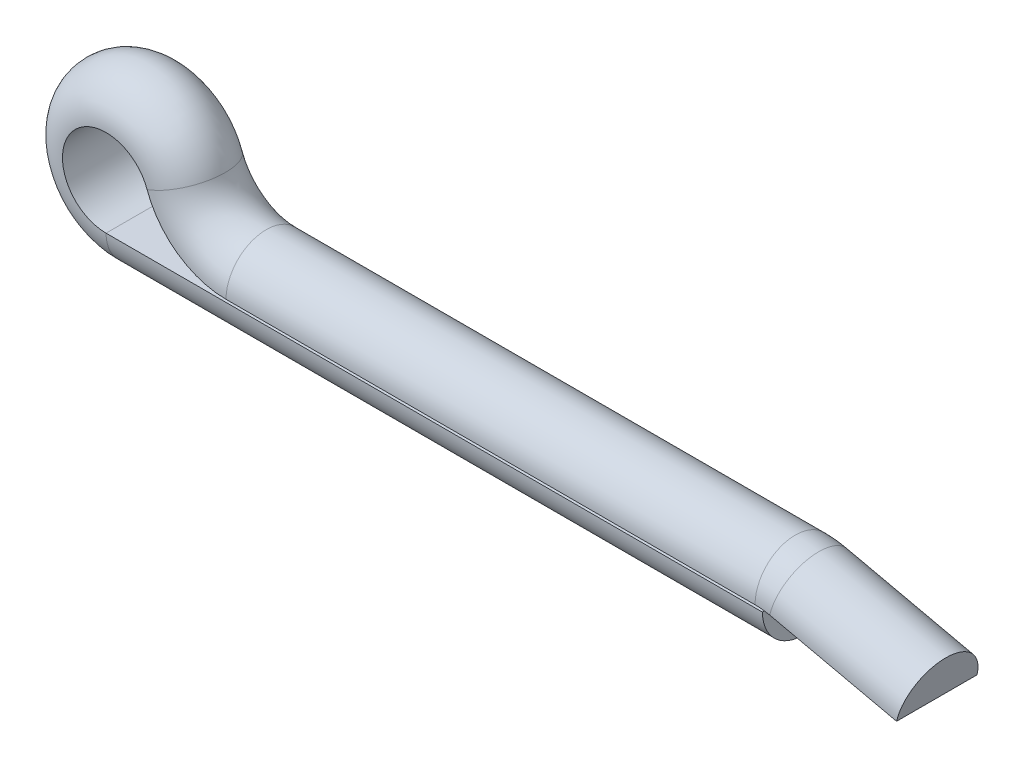
ISO-10303-21;
HEADER;
FILE_DESCRIPTION(('STEP AP214'),'2;1');
FILE_NAME('part.step','',(''),(''),'','','');
FILE_SCHEMA(('AUTOMOTIVE_DESIGN { 1 0 10303 214 1 1 1 1 }'));
ENDSEC;
DATA;
#1=APPLICATION_CONTEXT('core data for automotive mechanical design processes');
#2=APPLICATION_PROTOCOL_DEFINITION('international standard','automotive_design',2000,#1);
#3=PRODUCT_CONTEXT('',#1,'mechanical');
#4=PRODUCT('Part','Part','',(#3));
#5=PRODUCT_RELATED_PRODUCT_CATEGORY('part','',(#4));
#6=PRODUCT_DEFINITION_FORMATION('','',#4);
#7=PRODUCT_DEFINITION_CONTEXT('part definition',#1,'design');
#8=PRODUCT_DEFINITION('design','',#6,#7);
#9=PRODUCT_DEFINITION_SHAPE('','',#8);
#10=(LENGTH_UNIT() NAMED_UNIT(*) SI_UNIT(.MILLI.,.METRE.));
#11=(NAMED_UNIT(*) PLANE_ANGLE_UNIT() SI_UNIT($,.RADIAN.));
#12=(NAMED_UNIT(*) SI_UNIT($,.STERADIAN.) SOLID_ANGLE_UNIT());
#13=UNCERTAINTY_MEASURE_WITH_UNIT(LENGTH_MEASURE(1.E-05),#10,'distance_accuracy_value','');
#14=(GEOMETRIC_REPRESENTATION_CONTEXT(3) GLOBAL_UNCERTAINTY_ASSIGNED_CONTEXT((#13)) GLOBAL_UNIT_ASSIGNED_CONTEXT((#10,
#11,#12)) REPRESENTATION_CONTEXT('',''));
#15=CARTESIAN_POINT('',(0.,0.,0.));
#16=DIRECTION('',(0.,0.,1.));
#17=DIRECTION('',(1.,0.,0.));
#18=AXIS2_PLACEMENT_3D('',#15,#16,#17);
#19=CARTESIAN_POINT('',(0.137669376693772,-0.00557560975612573,0.762));
#20=DIRECTION('',(0.219512195121951,0.975609756097561,0.));
#21=DIRECTION('',(-0.975609756097561,0.219512195121951,0.));
#22=AXIS2_PLACEMENT_3D('',#19,#20,#21);
#23=PLANE('',#22);
#24=DIRECTION('',(0.,0.,1.));
#25=VECTOR('',#24,1.);
#26=CARTESIAN_POINT('',(0.137669376693772,-0.00557560975612573,0.762));
#27=LINE('',#26,#25);
#28=CARTESIAN_POINT('',(0.137669376693772,-0.00557560975612573,-0.762));
#29=VERTEX_POINT('',#28);
#30=CARTESIAN_POINT('',(0.137669376693772,-0.00557560975612573,0.762));
#31=VERTEX_POINT('',#30);
#32=EDGE_CURVE('E171',#29,#31,#27,.T.);
#33=ORIENTED_EDGE('',*,*,#32,.F.);
#34=DIRECTION('',(0.975609756097561,-0.219512195121951,0.));
#35=VECTOR('',#34,1.);
#36=CARTESIAN_POINT('',(0.137669376693772,-0.00557560975612573,-0.762));
#37=LINE('',#36,#35);
#38=CARTESIAN_POINT('',(2.54000000000001,-0.546100000000028,-0.762));
#39=VERTEX_POINT('',#38);
#40=EDGE_CURVE('E53',#29,#39,#37,.T.);
#41=ORIENTED_EDGE('',*,*,#40,.T.);
#42=DIRECTION('',(0.,0.,1.));
#43=VECTOR('',#42,1.);
#44=CARTESIAN_POINT('',(2.54000000000001,-0.546100000000028,0.762));
#45=LINE('',#44,#43);
#46=CARTESIAN_POINT('',(2.54000000000001,-0.546100000000028,0.762));
#47=VERTEX_POINT('',#46);
#48=EDGE_CURVE('E60',#39,#47,#45,.T.);
#49=ORIENTED_EDGE('',*,*,#48,.T.);
#50=DIRECTION('',(0.975609756097561,-0.219512195121951,0.));
#51=VECTOR('',#50,1.);
#52=CARTESIAN_POINT('',(0.137669376693772,-0.00557560975612573,0.762));
#53=LINE('',#52,#51);
#54=EDGE_CURVE('E13',#31,#47,#53,.T.);
#55=ORIENTED_EDGE('',*,*,#54,.F.);
#56=EDGE_LOOP('',(#33,#41,#49,#55));
#57=FACE_BOUND('',#56,.T.);
#58=ADVANCED_FACE('F46',(#57),#23,.F.);
#59=CARTESIAN_POINT('',(0.137669376693772,-0.00557560975612573,0.));
#60=DIRECTION('',(0.975609756097561,-0.219512195121951,0.));
#61=DIRECTION('',(0.219512195121951,0.975609756097561,0.));
#62=AXIS2_PLACEMENT_3D('',#59,#60,#61);
#63=CYLINDRICAL_SURFACE('',#62,0.762);
#64=CARTESIAN_POINT('',(0.137669376693772,-0.00557560975612573,0.));
#65=DIRECTION('',(-0.975609756097558,0.219512195121964,0.));
#66=DIRECTION('',(0.,0.,1.));
#67=AXIS2_PLACEMENT_3D('',#64,#65,#66);
#68=CIRCLE('',#67,0.762);
#69=EDGE_CURVE('E168',#31,#29,#68,.T.);
#70=ORIENTED_EDGE('',*,*,#69,.F.);
#71=ORIENTED_EDGE('',*,*,#54,.T.);
#72=CARTESIAN_POINT('',(2.54000000000001,-0.546100000000028,0.));
#73=DIRECTION('',(-0.975609756097558,0.219512195121964,0.));
#74=DIRECTION('',(0.,0.,1.));
#75=AXIS2_PLACEMENT_3D('',#72,#73,#74);
#76=CIRCLE('',#75,0.762);
#77=EDGE_CURVE('E66',#47,#39,#76,.T.);
#78=ORIENTED_EDGE('',*,*,#77,.T.);
#79=ORIENTED_EDGE('',*,*,#40,.F.);
#80=EDGE_LOOP('',(#70,#71,#78,#79));
#81=FACE_BOUND('',#80,.T.);
#82=ADVANCED_FACE('F183',(#81),#63,.T.);
#83=CARTESIAN_POINT('',(-0.141111111111112,-1.2446,0.));
#84=DIRECTION('',(0.,0.,-1.));
#85=DIRECTION('',(-1.,0.,0.));
#86=AXIS2_PLACEMENT_3D('',#83,#84,#85);
#87=CYLINDRICAL_SURFACE('',#86,1.26999999999997);
#88=DIRECTION('',(0.,0.,1.));
#89=VECTOR('',#88,1.);
#90=CARTESIAN_POINT('',(-0.141111111111101,0.0253999999999736,0.762));
#91=LINE('',#90,#89);
#92=CARTESIAN_POINT('',(-0.141111111111101,0.0253999999999736,-0.762));
#93=VERTEX_POINT('',#92);
#94=CARTESIAN_POINT('',(-0.141111111111101,0.0253999999999736,0.762));
#95=VERTEX_POINT('',#94);
#96=EDGE_CURVE('E159',#93,#95,#91,.T.);
#97=ORIENTED_EDGE('',*,*,#96,.F.);
#98=CARTESIAN_POINT('',(-0.141111111111112,-1.2446,-0.762));
#99=DIRECTION('',(0.,0.,-1.));
#100=DIRECTION('',(-1.,0.,0.));
#101=AXIS2_PLACEMENT_3D('',#98,#99,#100);
#102=CIRCLE('',#101,1.26999999999997);
#103=EDGE_CURVE('E174',#93,#29,#102,.T.);
#104=ORIENTED_EDGE('',*,*,#103,.T.);
#105=ORIENTED_EDGE('',*,*,#32,.T.);
#106=CARTESIAN_POINT('',(-0.141111111111112,-1.2446,0.762));
#107=DIRECTION('',(0.,0.,-1.));
#108=DIRECTION('',(-1.,0.,0.));
#109=AXIS2_PLACEMENT_3D('',#106,#107,#108);
#110=CIRCLE('',#109,1.26999999999997);
#111=EDGE_CURVE('E177',#95,#31,#110,.T.);
#112=ORIENTED_EDGE('',*,*,#111,.F.);
#113=EDGE_LOOP('',(#97,#104,#105,#112));
#114=FACE_BOUND('',#113,.T.);
#115=ADVANCED_FACE('F187',(#114),#87,.F.);
#116=CARTESIAN_POINT('',(-0.141111111111112,-1.2446,0.));
#117=DIRECTION('',(0.,0.,-1.));
#118=DIRECTION('',(-1.,0.,0.));
#119=AXIS2_PLACEMENT_3D('',#116,#117,#118);
#120=TOROIDAL_SURFACE('',#119,1.26999999999997,0.762);
#121=CARTESIAN_POINT('',(-0.141111111111101,0.0253999999999736,0.));
#122=DIRECTION('',(-1.,0.,0.));
#123=DIRECTION('',(0.,0.,1.));
#124=AXIS2_PLACEMENT_3D('',#121,#122,#123);
#125=CIRCLE('',#124,0.762);
#126=EDGE_CURVE('E156',#95,#93,#125,.T.);
#127=ORIENTED_EDGE('',*,*,#126,.F.);
#128=ORIENTED_EDGE('',*,*,#111,.T.);
#129=ORIENTED_EDGE('',*,*,#69,.T.);
#130=ORIENTED_EDGE('',*,*,#103,.F.);
#131=EDGE_LOOP('',(#127,#128,#129,#130));
#132=FACE_BOUND('',#131,.T.);
#133=ADVANCED_FACE('F189',(#132),#120,.T.);
#134=CARTESIAN_POINT('',(-10.16,0.0253999999999723,0.762));
#135=DIRECTION('',(0.,1.,0.));
#136=DIRECTION('',(-1.,0.,0.));
#137=AXIS2_PLACEMENT_3D('',#134,#135,#136);
#138=PLANE('',#137);
#139=DIRECTION('',(0.,0.,1.));
#140=VECTOR('',#139,1.);
#141=CARTESIAN_POINT('',(-10.16,0.0253999999999723,0.762));
#142=LINE('',#141,#140);
#143=CARTESIAN_POINT('',(-10.16,0.0253999999999723,-0.762));
#144=VERTEX_POINT('',#143);
#145=CARTESIAN_POINT('',(-10.16,0.0253999999999723,0.762));
#146=VERTEX_POINT('',#145);
#147=EDGE_CURVE('E147',#144,#146,#142,.T.);
#148=ORIENTED_EDGE('',*,*,#147,.F.);
#149=DIRECTION('',(1.,0.,0.));
#150=VECTOR('',#149,1.);
#151=CARTESIAN_POINT('',(-10.16,0.0253999999999723,-0.762));
#152=LINE('',#151,#150);
#153=EDGE_CURVE('E162',#144,#93,#152,.T.);
#154=ORIENTED_EDGE('',*,*,#153,.T.);
#155=ORIENTED_EDGE('',*,*,#96,.T.);
#156=DIRECTION('',(1.,0.,0.));
#157=VECTOR('',#156,1.);
#158=CARTESIAN_POINT('',(-10.16,0.0253999999999723,0.762));
#159=LINE('',#158,#157);
#160=EDGE_CURVE('E165',#146,#95,#159,.T.);
#161=ORIENTED_EDGE('',*,*,#160,.F.);
#162=EDGE_LOOP('',(#148,#154,#155,#161));
#163=FACE_BOUND('',#162,.T.);
#164=ADVANCED_FACE('F193',(#163),#138,.F.);
#165=CARTESIAN_POINT('',(-10.16,0.0253999999999723,0.));
#166=DIRECTION('',(1.,0.,0.));
#167=DIRECTION('',(0.,1.,0.));
#168=AXIS2_PLACEMENT_3D('',#165,#166,#167);
#169=CYLINDRICAL_SURFACE('',#168,0.762);
#170=CARTESIAN_POINT('',(-10.16,0.0253999999999723,0.));
#171=DIRECTION('',(-1.,0.,0.));
#172=DIRECTION('',(0.,0.,1.));
#173=AXIS2_PLACEMENT_3D('',#170,#171,#172);
#174=CIRCLE('',#173,0.762);
#175=EDGE_CURVE('E144',#146,#144,#174,.T.);
#176=ORIENTED_EDGE('',*,*,#175,.F.);
#177=ORIENTED_EDGE('',*,*,#160,.T.);
#178=ORIENTED_EDGE('',*,*,#126,.T.);
#179=ORIENTED_EDGE('',*,*,#153,.F.);
#180=EDGE_LOOP('',(#176,#177,#178,#179));
#181=FACE_BOUND('',#180,.T.);
#182=ADVANCED_FACE('F195',(#181),#169,.T.);
#183=CARTESIAN_POINT('',(-10.16,1.6129,0.));
#184=DIRECTION('',(0.,0.,1.));
#185=DIRECTION('',(1.,0.,0.));
#186=AXIS2_PLACEMENT_3D('',#183,#184,#185);
#187=CYLINDRICAL_SURFACE('',#186,1.58750000000003);
#188=DIRECTION('',(0.,0.,1.));
#189=VECTOR('',#188,1.);
#190=CARTESIAN_POINT('',(-11.6547283230391,1.07816315789471,0.762));
#191=LINE('',#190,#189);
#192=CARTESIAN_POINT('',(-11.6547283230391,1.07816315789471,-0.762));
#193=VERTEX_POINT('',#192);
#194=CARTESIAN_POINT('',(-11.6547283230391,1.07816315789471,0.762));
#195=VERTEX_POINT('',#194);
#196=EDGE_CURVE('E116',#193,#195,#191,.T.);
#197=ORIENTED_EDGE('',*,*,#196,.F.);
#198=CARTESIAN_POINT('',(-10.16,1.6129,-0.762));
#199=DIRECTION('',(0.,0.,1.));
#200=DIRECTION('',(1.,0.,0.));
#201=AXIS2_PLACEMENT_3D('',#198,#199,#200);
#202=CIRCLE('',#201,1.58750000000003);
#203=EDGE_CURVE('E150',#193,#144,#202,.T.);
#204=ORIENTED_EDGE('',*,*,#203,.T.);
#205=ORIENTED_EDGE('',*,*,#147,.T.);
#206=CARTESIAN_POINT('',(-10.16,1.6129,0.762));
#207=DIRECTION('',(0.,0.,1.));
#208=DIRECTION('',(1.,0.,0.));
#209=AXIS2_PLACEMENT_3D('',#206,#207,#208);
#210=CIRCLE('',#209,1.58750000000003);
#211=EDGE_CURVE('E153',#195,#146,#210,.T.);
#212=ORIENTED_EDGE('',*,*,#211,.F.);
#213=EDGE_LOOP('',(#197,#204,#205,#212));
#214=FACE_BOUND('',#213,.T.);
#215=ADVANCED_FACE('F199',(#214),#187,.T.);
#216=CARTESIAN_POINT('',(-10.16,1.6129,0.));
#217=DIRECTION('',(0.,0.,1.));
#218=DIRECTION('',(1.,0.,0.));
#219=AXIS2_PLACEMENT_3D('',#216,#217,#218);
#220=TOROIDAL_SURFACE('',#219,1.58750000000003,0.762);
#221=CARTESIAN_POINT('',(-11.6547283230391,1.07816315789471,0.));
#222=DIRECTION('',(-0.336842105263148,0.941561148371092,0.));
#223=DIRECTION('',(0.,0.,1.));
#224=AXIS2_PLACEMENT_3D('',#221,#222,#223);
#225=CIRCLE('',#224,0.762);
#226=EDGE_CURVE('E112',#195,#193,#225,.T.);
#227=ORIENTED_EDGE('',*,*,#226,.F.);
#228=ORIENTED_EDGE('',*,*,#211,.T.);
#229=ORIENTED_EDGE('',*,*,#175,.T.);
#230=ORIENTED_EDGE('',*,*,#203,.F.);
#231=EDGE_LOOP('',(#227,#228,#229,#230));
#232=FACE_BOUND('',#231,.T.);
#233=ADVANCED_FACE('F200',(#232),#220,.T.);
#234=CARTESIAN_POINT('',(-12.4319870510194,0.800099999999994,0.));
#235=DIRECTION('',(0.,0.,-1.));
#236=DIRECTION('',(-1.,0.,0.));
#237=AXIS2_PLACEMENT_3D('',#234,#235,#236);
#238=CYLINDRICAL_SURFACE('',#237,0.825499999999975);
#239=DIRECTION('',(0.,0.,1.));
#240=VECTOR('',#239,1.);
#241=CARTESIAN_POINT('',(-12.4319870510194,-0.0253999999999813,0.762));
#242=LINE('',#241,#240);
#243=CARTESIAN_POINT('',(-12.4319870510194,-0.0253999999999813,-0.762));
#244=VERTEX_POINT('',#243);
#245=CARTESIAN_POINT('',(-12.4319870510194,-0.0253999999999813,0.762));
#246=VERTEX_POINT('',#245);
#247=EDGE_CURVE('E119',#244,#246,#242,.T.);
#248=ORIENTED_EDGE('',*,*,#247,.F.);
#249=CARTESIAN_POINT('',(-12.4319870510194,0.800099999999994,-0.762));
#250=DIRECTION('',(0.,0.,-1.));
#251=DIRECTION('',(-1.,0.,0.));
#252=AXIS2_PLACEMENT_3D('',#249,#250,#251);
#253=CIRCLE('',#252,0.825499999999975);
#254=EDGE_CURVE('E104',#244,#193,#253,.T.);
#255=ORIENTED_EDGE('',*,*,#254,.T.);
#256=ORIENTED_EDGE('',*,*,#196,.T.);
#257=CARTESIAN_POINT('',(-12.4319870510194,0.800099999999994,0.762));
#258=DIRECTION('',(0.,0.,-1.));
#259=DIRECTION('',(-1.,0.,0.));
#260=AXIS2_PLACEMENT_3D('',#257,#258,#259);
#261=CIRCLE('',#260,0.825499999999975);
#262=EDGE_CURVE('E115',#246,#195,#261,.T.);
#263=ORIENTED_EDGE('',*,*,#262,.F.);
#264=EDGE_LOOP('',(#248,#255,#256,#263));
#265=FACE_BOUND('',#264,.T.);
#266=ADVANCED_FACE('F121',(#265),#238,.F.);
#267=CARTESIAN_POINT('',(-12.4319870510194,0.800099999999994,0.));
#268=DIRECTION('',(0.,0.,-1.));
#269=DIRECTION('',(-1.,0.,0.));
#270=AXIS2_PLACEMENT_3D('',#267,#268,#269);
#271=TOROIDAL_SURFACE('',#270,0.825499999999975,0.762);
#272=CARTESIAN_POINT('',(-12.4319870510194,-0.0253999999999813,0.));
#273=DIRECTION('',(1.,0.,0.));
#274=DIRECTION('',(0.,0.,1.));
#275=AXIS2_PLACEMENT_3D('',#272,#273,#274);
#276=CIRCLE('',#275,0.762);
#277=EDGE_CURVE('E109',#246,#244,#276,.T.);
#278=ORIENTED_EDGE('',*,*,#277,.F.);
#279=ORIENTED_EDGE('',*,*,#262,.T.);
#280=ORIENTED_EDGE('',*,*,#226,.T.);
#281=ORIENTED_EDGE('',*,*,#254,.F.);
#282=EDGE_LOOP('',(#278,#279,#280,#281));
#283=FACE_BOUND('',#282,.T.);
#284=ADVANCED_FACE('F106',(#283),#271,.T.);
#285=CARTESIAN_POINT('',(-12.4319870510194,-0.0253999999999813,0.));
#286=DIRECTION('',(1.,0.,0.));
#287=DIRECTION('',(0.,1.,0.));
#288=AXIS2_PLACEMENT_3D('',#285,#286,#287);
#289=CYLINDRICAL_SURFACE('',#288,0.762);
#290=CARTESIAN_POINT('',(0.,-0.0254,0.));
#291=DIRECTION('',(1.,0.,0.));
#292=DIRECTION('',(0.,0.,1.));
#293=AXIS2_PLACEMENT_3D('',#290,#291,#292);
#294=CIRCLE('',#293,0.762);
#295=CARTESIAN_POINT('',(0.,-0.0254,0.762));
#296=VERTEX_POINT('',#295);
#297=CARTESIAN_POINT('',(0.,-0.0254,-0.762));
#298=VERTEX_POINT('',#297);
#299=EDGE_CURVE('E136',#296,#298,#294,.T.);
#300=ORIENTED_EDGE('',*,*,#299,.F.);
#301=DIRECTION('',(1.,0.,0.));
#302=VECTOR('',#301,1.);
#303=CARTESIAN_POINT('',(-12.4319870510194,-0.0253999999999813,0.762));
#304=LINE('',#303,#302);
#305=EDGE_CURVE('E132',#246,#296,#304,.T.);
#306=ORIENTED_EDGE('',*,*,#305,.F.);
#307=ORIENTED_EDGE('',*,*,#277,.T.);
#308=DIRECTION('',(1.,0.,0.));
#309=VECTOR('',#308,1.);
#310=CARTESIAN_POINT('',(-12.4319870510194,-0.0253999999999813,-0.762));
#311=LINE('',#310,#309);
#312=EDGE_CURVE('E123',#244,#298,#311,.T.);
#313=ORIENTED_EDGE('',*,*,#312,.T.);
#314=EDGE_LOOP('',(#300,#306,#307,#313));
#315=FACE_BOUND('',#314,.T.);
#316=ADVANCED_FACE('F134',(#315),#289,.T.);
#317=CARTESIAN_POINT('',(-12.4319870510194,-0.0253999999999813,0.762));
#318=DIRECTION('',(0.,1.,0.));
#319=DIRECTION('',(-1.,0.,0.));
#320=AXIS2_PLACEMENT_3D('',#317,#318,#319);
#321=PLANE('',#320);
#322=DIRECTION('',(0.,0.,1.));
#323=VECTOR('',#322,1.);
#324=CARTESIAN_POINT('',(0.,-0.0254,0.762));
#325=LINE('',#324,#323);
#326=EDGE_CURVE('E128',#298,#296,#325,.T.);
#327=ORIENTED_EDGE('',*,*,#326,.F.);
#328=ORIENTED_EDGE('',*,*,#312,.F.);
#329=ORIENTED_EDGE('',*,*,#247,.T.);
#330=ORIENTED_EDGE('',*,*,#305,.T.);
#331=EDGE_LOOP('',(#327,#328,#329,#330));
#332=FACE_BOUND('',#331,.T.);
#333=ADVANCED_FACE('F126',(#332),#321,.T.);
#334=CARTESIAN_POINT('',(2.54000000000001,-0.546100000000028,0.));
#335=DIRECTION('',(0.975609756097558,-0.219512195121964,0.));
#336=DIRECTION('',(0.,0.,1.));
#337=AXIS2_PLACEMENT_3D('',#334,#335,#336);
#338=PLANE('',#337);
#339=ORIENTED_EDGE('',*,*,#77,.F.);
#340=ORIENTED_EDGE('',*,*,#48,.F.);
#341=EDGE_LOOP('',(#339,#340));
#342=FACE_BOUND('',#341,.T.);
#343=ADVANCED_FACE('F266',(#342),#338,.T.);
#344=CARTESIAN_POINT('',(0.,-0.0254,0.));
#345=DIRECTION('',(-1.,0.,0.));
#346=DIRECTION('',(0.,0.,1.));
#347=AXIS2_PLACEMENT_3D('',#344,#345,#346);
#348=PLANE('',#347);
#349=ORIENTED_EDGE('',*,*,#299,.T.);
#350=ORIENTED_EDGE('',*,*,#326,.T.);
#351=EDGE_LOOP('',(#349,#350));
#352=FACE_BOUND('',#351,.T.);
#353=ADVANCED_FACE('F275',(#352),#348,.F.);
#354=CLOSED_SHELL('',(#58,#82,#115,#133,#164,#182,#215,#233,#266,#284,#316,#333,#343,#353));
#355=MANIFOLD_SOLID_BREP('B2',#354);
#356=ADVANCED_BREP_SHAPE_REPRESENTATION('',(#18,#355),#14);
#357=SHAPE_DEFINITION_REPRESENTATION(#9,#356);
ENDSEC;
END-ISO-10303-21;
